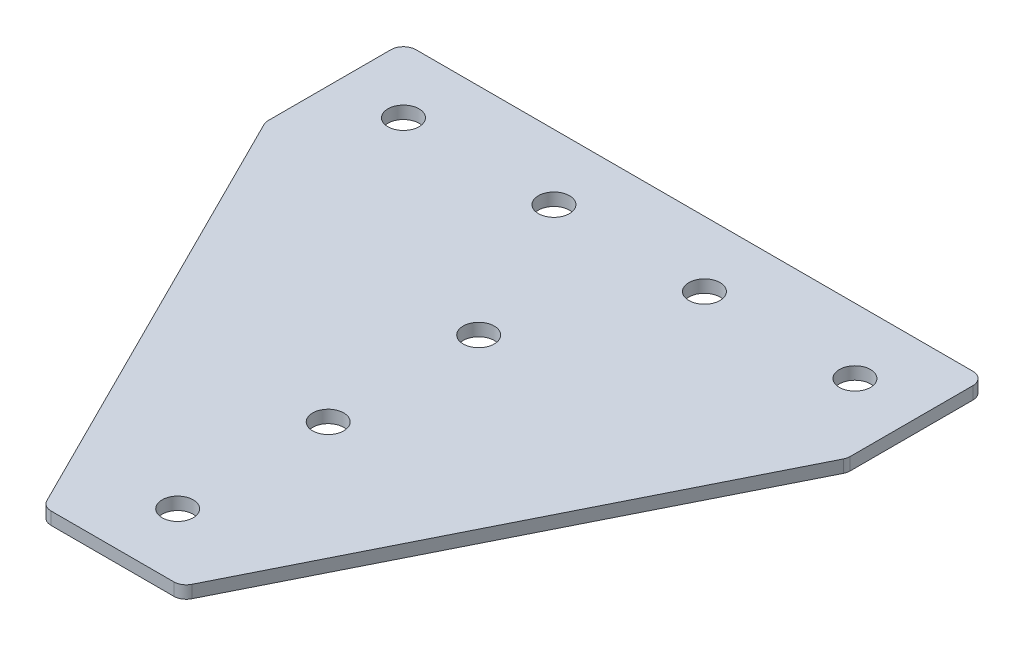
ISO-10303-21;
HEADER;
FILE_DESCRIPTION(('STEP AP214'),'2;1');
FILE_NAME('part.step','',(''),(''),'','','');
FILE_SCHEMA(('AUTOMOTIVE_DESIGN { 1 0 10303 214 1 1 1 1 }'));
ENDSEC;
DATA;
#1=APPLICATION_CONTEXT('core data for automotive mechanical design processes');
#2=APPLICATION_PROTOCOL_DEFINITION('international standard','automotive_design',2000,#1);
#3=PRODUCT_CONTEXT('',#1,'mechanical');
#4=PRODUCT('Part','Part','',(#3));
#5=PRODUCT_RELATED_PRODUCT_CATEGORY('part','',(#4));
#6=PRODUCT_DEFINITION_FORMATION('','',#4);
#7=PRODUCT_DEFINITION_CONTEXT('part definition',#1,'design');
#8=PRODUCT_DEFINITION('design','',#6,#7);
#9=PRODUCT_DEFINITION_SHAPE('','',#8);
#10=(LENGTH_UNIT() NAMED_UNIT(*) SI_UNIT(.MILLI.,.METRE.));
#11=(NAMED_UNIT(*) PLANE_ANGLE_UNIT() SI_UNIT($,.RADIAN.));
#12=(NAMED_UNIT(*) SI_UNIT($,.STERADIAN.) SOLID_ANGLE_UNIT());
#13=UNCERTAINTY_MEASURE_WITH_UNIT(LENGTH_MEASURE(1.E-05),#10,'distance_accuracy_value','');
#14=(GEOMETRIC_REPRESENTATION_CONTEXT(3) GLOBAL_UNCERTAINTY_ASSIGNED_CONTEXT((#13)) GLOBAL_UNIT_ASSIGNED_CONTEXT((#10,
#11,#12)) REPRESENTATION_CONTEXT('',''));
#15=CARTESIAN_POINT('',(0.,0.,0.));
#16=DIRECTION('',(0.,0.,1.));
#17=DIRECTION('',(1.,0.,0.));
#18=AXIS2_PLACEMENT_3D('',#15,#16,#17);
#19=CARTESIAN_POINT('',(30.3085714285715,-1.25,-47.2019047619047));
#20=DIRECTION('',(0.,-1.,0.));
#21=DIRECTION('',(0.,0.,-1.));
#22=AXIS2_PLACEMENT_3D('',#19,#20,#21);
#23=PLANE('',#22);
#24=CARTESIAN_POINT('',(30.3085714285715,-1.25,-17.2019047619047));
#25=DIRECTION('',(0.,1.,0.));
#26=DIRECTION('',(0.,0.,1.));
#27=AXIS2_PLACEMENT_3D('',#24,#25,#26);
#28=CIRCLE('',#27,3.1);
#29=CARTESIAN_POINT('',(30.3085714285715,-1.25,-14.1019047619047));
#30=VERTEX_POINT('',#29);
#31=EDGE_CURVE('E183',#30,#30,#28,.T.);
#32=ORIENTED_EDGE('',*,*,#31,.T.);
#33=EDGE_LOOP('',(#32));
#34=FACE_BOUND('',#33,.T.);
#35=DIRECTION('',(1.,0.,0.));
#36=VECTOR('',#35,1.);
#37=CARTESIAN_POINT('',(17.3085714285714,-1.25,55.7980952380952));
#38=LINE('',#37,#36);
#39=CARTESIAN_POINT('',(18.0897243779459,-1.25,55.7980952380952));
#40=VERTEX_POINT('',#39);
#41=CARTESIAN_POINT('',(42.527418479197,-1.25,55.7980952380952));
#42=VERTEX_POINT('',#41);
#43=EDGE_CURVE('E201',#40,#42,#38,.T.);
#44=ORIENTED_EDGE('',*,*,#43,.F.);
#45=CARTESIAN_POINT('',(18.0897243779459,-1.25,53.2980952380952));
#46=DIRECTION('',(0.,1.,0.));
#47=DIRECTION('',(0.,0.,-1.));
#48=AXIS2_PLACEMENT_3D('',#45,#46,#47);
#49=CIRCLE('',#48,2.5);
#50=CARTESIAN_POINT('',(15.8536564004461,-1.25,54.4161292268451));
#51=VERTEX_POINT('',#50);
#52=EDGE_CURVE('E155',#51,#40,#49,.T.);
#53=ORIENTED_EDGE('',*,*,#52,.F.);
#54=DIRECTION('',(-0.447213595499957,0.,-0.894427190999917));
#55=VECTOR('',#54,1.);
#56=CARTESIAN_POINT('',(16.5446394060712,-1.25,55.7980952380952));
#57=LINE('',#56,#55);
#58=CARTESIAN_POINT('',(-27.4274965489282,-1.25,-32.1461766719039));
#59=VERTEX_POINT('',#58);
#60=EDGE_CURVE('E142',#51,#59,#57,.T.);
#61=ORIENTED_EDGE('',*,*,#60,.T.);
#62=CARTESIAN_POINT('',(-25.1914285714284,-1.25,-33.2642106606537));
#63=DIRECTION('',(0.,1.,0.));
#64=DIRECTION('',(0.,0.,-1.));
#65=AXIS2_PLACEMENT_3D('',#62,#63,#64);
#66=CIRCLE('',#65,2.5);
#67=CARTESIAN_POINT('',(-27.6914285714284,-1.25,-33.2642106606537));
#68=VERTEX_POINT('',#67);
#69=EDGE_CURVE('E153',#68,#59,#66,.T.);
#70=ORIENTED_EDGE('',*,*,#69,.F.);
#71=DIRECTION('',(0.,0.,-1.));
#72=VECTOR('',#71,1.);
#73=CARTESIAN_POINT('',(-27.6914285714284,-1.25,-32.6740407169042));
#74=LINE('',#73,#72);
#75=CARTESIAN_POINT('',(-27.6914285714284,-1.25,-57.7019047619047));
#76=VERTEX_POINT('',#75);
#77=EDGE_CURVE('E124',#68,#76,#74,.T.);
#78=ORIENTED_EDGE('',*,*,#77,.T.);
#79=CARTESIAN_POINT('',(-25.1914285714284,-1.25,-57.7019047619047));
#80=DIRECTION('',(0.,1.,0.));
#81=DIRECTION('',(0.,0.,-1.));
#82=AXIS2_PLACEMENT_3D('',#79,#80,#81);
#83=CIRCLE('',#82,2.5);
#84=CARTESIAN_POINT('',(-25.1914285714284,-1.25,-60.2019047619047));
#85=VERTEX_POINT('',#84);
#86=EDGE_CURVE('E150',#85,#76,#83,.T.);
#87=ORIENTED_EDGE('',*,*,#86,.F.);
#88=DIRECTION('',(-1.,0.,0.));
#89=VECTOR('',#88,1.);
#90=CARTESIAN_POINT('',(88.3085714285713,-1.25,-60.2019047619048));
#91=LINE('',#90,#89);
#92=CARTESIAN_POINT('',(85.8085714285713,-1.25,-60.2019047619048));
#93=VERTEX_POINT('',#92);
#94=EDGE_CURVE('E198',#93,#85,#91,.T.);
#95=ORIENTED_EDGE('',*,*,#94,.F.);
#96=CARTESIAN_POINT('',(85.8085714285713,-1.25,-57.7019047619048));
#97=DIRECTION('',(0.,-1.,0.));
#98=DIRECTION('',(0.,0.,-1.));
#99=AXIS2_PLACEMENT_3D('',#96,#97,#98);
#100=CIRCLE('',#99,2.5);
#101=CARTESIAN_POINT('',(88.3085714285713,-1.25,-57.7019047619048));
#102=VERTEX_POINT('',#101);
#103=EDGE_CURVE('E222',#93,#102,#100,.T.);
#104=ORIENTED_EDGE('',*,*,#103,.T.);
#105=DIRECTION('',(0.,0.,-1.));
#106=VECTOR('',#105,1.);
#107=CARTESIAN_POINT('',(88.3085714285713,-1.25,-32.6740407169043));
#108=LINE('',#107,#106);
#109=CARTESIAN_POINT('',(88.3085714285713,-1.25,-33.2642106606537));
#110=VERTEX_POINT('',#109);
#111=EDGE_CURVE('E195',#110,#102,#108,.T.);
#112=ORIENTED_EDGE('',*,*,#111,.F.);
#113=CARTESIAN_POINT('',(85.8085714285713,-1.25,-33.2642106606537));
#114=DIRECTION('',(0.,-1.,0.));
#115=DIRECTION('',(0.,0.,-1.));
#116=AXIS2_PLACEMENT_3D('',#113,#114,#115);
#117=CIRCLE('',#116,2.5);
#118=CARTESIAN_POINT('',(88.0446394060712,-1.25,-32.1461766719039));
#119=VERTEX_POINT('',#118);
#120=EDGE_CURVE('E31',#110,#119,#117,.T.);
#121=ORIENTED_EDGE('',*,*,#120,.T.);
#122=DIRECTION('',(0.447213595499957,0.,-0.894427190999917));
#123=VECTOR('',#122,1.);
#124=CARTESIAN_POINT('',(44.0725034510718,-1.25,55.7980952380952));
#125=LINE('',#124,#123);
#126=CARTESIAN_POINT('',(44.7634864566968,-1.25,54.4161292268451));
#127=VERTEX_POINT('',#126);
#128=EDGE_CURVE('E203',#127,#119,#125,.T.);
#129=ORIENTED_EDGE('',*,*,#128,.F.);
#130=CARTESIAN_POINT('',(42.527418479197,-1.25,53.2980952380952));
#131=DIRECTION('',(0.,-1.,0.));
#132=DIRECTION('',(0.,0.,-1.));
#133=AXIS2_PLACEMENT_3D('',#130,#131,#132);
#134=CIRCLE('',#133,2.5);
#135=EDGE_CURVE('E225',#127,#42,#134,.T.);
#136=ORIENTED_EDGE('',*,*,#135,.T.);
#137=EDGE_LOOP('',(#44,#53,#61,#70,#78,#87,#95,#104,#112,#121,#129,#136));
#138=FACE_BOUND('',#137,.T.);
#139=CARTESIAN_POINT('',(30.3085714285715,-1.25,42.7980952380953));
#140=DIRECTION('',(0.,1.,0.));
#141=DIRECTION('',(0.,0.,1.));
#142=AXIS2_PLACEMENT_3D('',#139,#140,#141);
#143=CIRCLE('',#142,3.1);
#144=CARTESIAN_POINT('',(30.3085714285715,-1.25,45.8980952380953));
#145=VERTEX_POINT('',#144);
#146=EDGE_CURVE('E171',#145,#145,#143,.T.);
#147=ORIENTED_EDGE('',*,*,#146,.T.);
#148=EDGE_LOOP('',(#147));
#149=FACE_BOUND('',#148,.T.);
#150=CARTESIAN_POINT('',(30.3085714285715,-1.25,12.7980952380953));
#151=DIRECTION('',(0.,1.,0.));
#152=DIRECTION('',(0.,0.,1.));
#153=AXIS2_PLACEMENT_3D('',#150,#151,#152);
#154=CIRCLE('',#153,3.1);
#155=CARTESIAN_POINT('',(30.3085714285715,-1.25,15.8980952380953));
#156=VERTEX_POINT('',#155);
#157=EDGE_CURVE('E177',#156,#156,#154,.T.);
#158=ORIENTED_EDGE('',*,*,#157,.T.);
#159=EDGE_LOOP('',(#158));
#160=FACE_BOUND('',#159,.T.);
#161=CARTESIAN_POINT('',(75.3085714285715,-1.25,-47.2019047619047));
#162=DIRECTION('',(0.,1.,0.));
#163=DIRECTION('',(0.,0.,1.));
#164=AXIS2_PLACEMENT_3D('',#161,#162,#163);
#165=CIRCLE('',#164,3.1);
#166=CARTESIAN_POINT('',(75.3085714285715,-1.25,-44.1019047619047));
#167=VERTEX_POINT('',#166);
#168=EDGE_CURVE('E165',#167,#167,#165,.T.);
#169=ORIENTED_EDGE('',*,*,#168,.T.);
#170=EDGE_LOOP('',(#169));
#171=FACE_BOUND('',#170,.T.);
#172=CARTESIAN_POINT('',(45.3085714285715,-1.25,-47.2019047619047));
#173=DIRECTION('',(0.,1.,0.));
#174=DIRECTION('',(0.,0.,1.));
#175=AXIS2_PLACEMENT_3D('',#172,#173,#174);
#176=CIRCLE('',#175,3.1);
#177=CARTESIAN_POINT('',(45.3085714285715,-1.25,-44.1019047619047));
#178=VERTEX_POINT('',#177);
#179=EDGE_CURVE('E189',#178,#178,#176,.T.);
#180=ORIENTED_EDGE('',*,*,#179,.T.);
#181=EDGE_LOOP('',(#180));
#182=FACE_BOUND('',#181,.T.);
#183=CARTESIAN_POINT('',(-14.6914285714285,-1.25,-47.2019047619047));
#184=DIRECTION('',(0.,-1.,0.));
#185=DIRECTION('',(0.,0.,1.));
#186=AXIS2_PLACEMENT_3D('',#183,#184,#185);
#187=CIRCLE('',#186,3.1);
#188=CARTESIAN_POINT('',(-14.6914285714285,-1.25,-44.1019047619047));
#189=VERTEX_POINT('',#188);
#190=EDGE_CURVE('E265',#189,#189,#187,.T.);
#191=ORIENTED_EDGE('',*,*,#190,.F.);
#192=EDGE_LOOP('',(#191));
#193=FACE_BOUND('',#192,.T.);
#194=CARTESIAN_POINT('',(15.3085714285715,-1.25,-47.2019047619047));
#195=DIRECTION('',(0.,-1.,0.));
#196=DIRECTION('',(0.,0.,1.));
#197=AXIS2_PLACEMENT_3D('',#194,#195,#196);
#198=CIRCLE('',#197,3.1);
#199=CARTESIAN_POINT('',(15.3085714285715,-1.25,-44.1019047619047));
#200=VERTEX_POINT('',#199);
#201=EDGE_CURVE('E135',#200,#200,#198,.T.);
#202=ORIENTED_EDGE('',*,*,#201,.F.);
#203=EDGE_LOOP('',(#202));
#204=FACE_BOUND('',#203,.T.);
#205=ADVANCED_FACE('F16',(#34,#138,#149,#160,#171,#182,#193,#204),#23,.T.);
#206=CARTESIAN_POINT('',(88.3085714285713,-1.25,-32.6740407169043));
#207=DIRECTION('',(1.,0.,0.));
#208=DIRECTION('',(0.,0.,-1.));
#209=AXIS2_PLACEMENT_3D('',#206,#207,#208);
#210=PLANE('',#209);
#211=DIRECTION('',(0.,0.,-1.));
#212=VECTOR('',#211,1.);
#213=CARTESIAN_POINT('',(88.3085714285713,1.25,-32.6740407169043));
#214=LINE('',#213,#212);
#215=CARTESIAN_POINT('',(88.3085714285713,1.25,-33.2642106606537));
#216=VERTEX_POINT('',#215);
#217=CARTESIAN_POINT('',(88.3085714285713,1.25,-57.7019047619048));
#218=VERTEX_POINT('',#217);
#219=EDGE_CURVE('E192',#216,#218,#214,.T.);
#220=ORIENTED_EDGE('',*,*,#219,.F.);
#221=DIRECTION('',(0.,1.,0.));
#222=VECTOR('',#221,1.);
#223=CARTESIAN_POINT('',(88.3085714285713,-1.25,-33.2642106606537));
#224=LINE('',#223,#222);
#225=EDGE_CURVE('E24',#216,#110,#224,.F.);
#226=ORIENTED_EDGE('',*,*,#225,.T.);
#227=ORIENTED_EDGE('',*,*,#111,.T.);
#228=DIRECTION('',(0.,1.,0.));
#229=VECTOR('',#228,1.);
#230=CARTESIAN_POINT('',(88.3085714285713,-1.25,-57.7019047619048));
#231=LINE('',#230,#229);
#232=EDGE_CURVE('E232',#102,#218,#231,.T.);
#233=ORIENTED_EDGE('',*,*,#232,.T.);
#234=EDGE_LOOP('',(#220,#226,#227,#233));
#235=FACE_BOUND('',#234,.T.);
#236=ADVANCED_FACE('F237',(#235),#210,.T.);
#237=CARTESIAN_POINT('',(44.0725034510718,-1.25,55.7980952380952));
#238=DIRECTION('',(0.894427190999916,0.,0.447213595499956));
#239=DIRECTION('',(0.447213595499957,0.,-0.894427190999917));
#240=AXIS2_PLACEMENT_3D('',#237,#238,#239);
#241=PLANE('',#240);
#242=DIRECTION('',(0.447213595499957,0.,-0.894427190999917));
#243=VECTOR('',#242,1.);
#244=CARTESIAN_POINT('',(44.0725034510718,1.25,55.7980952380952));
#245=LINE('',#244,#243);
#246=CARTESIAN_POINT('',(44.7634864566968,1.25,54.4161292268451));
#247=VERTEX_POINT('',#246);
#248=CARTESIAN_POINT('',(88.0446394060712,1.25,-32.1461766719039));
#249=VERTEX_POINT('',#248);
#250=EDGE_CURVE('E199',#247,#249,#245,.T.);
#251=ORIENTED_EDGE('',*,*,#250,.F.);
#252=DIRECTION('',(0.,1.,0.));
#253=VECTOR('',#252,1.);
#254=CARTESIAN_POINT('',(44.7634864566968,-1.25,54.4161292268451));
#255=LINE('',#254,#253);
#256=EDGE_CURVE('E38',#247,#127,#255,.F.);
#257=ORIENTED_EDGE('',*,*,#256,.T.);
#258=ORIENTED_EDGE('',*,*,#128,.T.);
#259=DIRECTION('',(0.,1.,0.));
#260=VECTOR('',#259,1.);
#261=CARTESIAN_POINT('',(88.0446394060711,-1.25,-32.1461766719038));
#262=LINE('',#261,#260);
#263=EDGE_CURVE('E228',#119,#249,#262,.T.);
#264=ORIENTED_EDGE('',*,*,#263,.T.);
#265=EDGE_LOOP('',(#251,#257,#258,#264));
#266=FACE_BOUND('',#265,.T.);
#267=ADVANCED_FACE('F245',(#266),#241,.T.);
#268=CARTESIAN_POINT('',(17.3085714285714,-1.25,55.7980952380952));
#269=DIRECTION('',(0.,0.,1.));
#270=DIRECTION('',(1.,0.,0.));
#271=AXIS2_PLACEMENT_3D('',#268,#269,#270);
#272=PLANE('',#271);
#273=DIRECTION('',(1.,0.,0.));
#274=VECTOR('',#273,1.);
#275=CARTESIAN_POINT('',(17.3085714285714,1.25,55.7980952380952));
#276=LINE('',#275,#274);
#277=CARTESIAN_POINT('',(18.0897243779459,1.25,55.7980952380952));
#278=VERTEX_POINT('',#277);
#279=CARTESIAN_POINT('',(42.527418479197,1.25,55.7980952380952));
#280=VERTEX_POINT('',#279);
#281=EDGE_CURVE('E210',#278,#280,#276,.T.);
#282=ORIENTED_EDGE('',*,*,#281,.F.);
#283=DIRECTION('',(0.,1.,0.));
#284=VECTOR('',#283,1.);
#285=CARTESIAN_POINT('',(18.0897243779459,-1.25,55.7980952380952));
#286=LINE('',#285,#284);
#287=EDGE_CURVE('E147',#40,#278,#286,.T.);
#288=ORIENTED_EDGE('',*,*,#287,.F.);
#289=ORIENTED_EDGE('',*,*,#43,.T.);
#290=DIRECTION('',(0.,1.,0.));
#291=VECTOR('',#290,1.);
#292=CARTESIAN_POINT('',(42.527418479197,-1.25,55.7980952380952));
#293=LINE('',#292,#291);
#294=EDGE_CURVE('E219',#42,#280,#293,.T.);
#295=ORIENTED_EDGE('',*,*,#294,.T.);
#296=EDGE_LOOP('',(#282,#288,#289,#295));
#297=FACE_BOUND('',#296,.T.);
#298=ADVANCED_FACE('F252',(#297),#272,.T.);
#299=CARTESIAN_POINT('',(88.3085714285713,-1.25,-60.2019047619048));
#300=DIRECTION('',(0.,0.,-1.));
#301=DIRECTION('',(-1.,0.,0.));
#302=AXIS2_PLACEMENT_3D('',#299,#300,#301);
#303=PLANE('',#302);
#304=ORIENTED_EDGE('',*,*,#94,.T.);
#305=DIRECTION('',(0.,1.,0.));
#306=VECTOR('',#305,1.);
#307=CARTESIAN_POINT('',(-25.1914285714284,-1.25,-60.2019047619047));
#308=LINE('',#307,#306);
#309=CARTESIAN_POINT('',(-25.1914285714284,1.25,-60.2019047619047));
#310=VERTEX_POINT('',#309);
#311=EDGE_CURVE('E126',#310,#85,#308,.F.);
#312=ORIENTED_EDGE('',*,*,#311,.F.);
#313=DIRECTION('',(-1.,0.,0.));
#314=VECTOR('',#313,1.);
#315=CARTESIAN_POINT('',(88.3085714285713,1.25,-60.2019047619048));
#316=LINE('',#315,#314);
#317=CARTESIAN_POINT('',(85.8085714285713,1.25,-60.2019047619048));
#318=VERTEX_POINT('',#317);
#319=EDGE_CURVE('E208',#318,#310,#316,.T.);
#320=ORIENTED_EDGE('',*,*,#319,.F.);
#321=DIRECTION('',(0.,1.,0.));
#322=VECTOR('',#321,1.);
#323=CARTESIAN_POINT('',(85.8085714285713,-1.25,-60.2019047619048));
#324=LINE('',#323,#322);
#325=EDGE_CURVE('E10',#318,#93,#324,.F.);
#326=ORIENTED_EDGE('',*,*,#325,.T.);
#327=EDGE_LOOP('',(#304,#312,#320,#326));
#328=FACE_BOUND('',#327,.T.);
#329=ADVANCED_FACE('F290',(#328),#303,.T.);
#330=CARTESIAN_POINT('',(30.3085714285715,1.25,-47.2019047619047));
#331=DIRECTION('',(0.,-1.,0.));
#332=DIRECTION('',(0.,0.,-1.));
#333=AXIS2_PLACEMENT_3D('',#330,#331,#332);
#334=PLANE('',#333);
#335=CARTESIAN_POINT('',(30.3085714285715,1.25,-17.2019047619047));
#336=DIRECTION('',(0.,1.,0.));
#337=DIRECTION('',(0.,0.,1.));
#338=AXIS2_PLACEMENT_3D('',#335,#336,#337);
#339=CIRCLE('',#338,3.1);
#340=CARTESIAN_POINT('',(30.3085714285715,1.25,-14.1019047619047));
#341=VERTEX_POINT('',#340);
#342=EDGE_CURVE('E180',#341,#341,#339,.T.);
#343=ORIENTED_EDGE('',*,*,#342,.F.);
#344=EDGE_LOOP('',(#343));
#345=FACE_BOUND('',#344,.T.);
#346=CARTESIAN_POINT('',(18.0897243779459,1.25,53.2980952380952));
#347=DIRECTION('',(0.,1.,0.));
#348=DIRECTION('',(0.,0.,-1.));
#349=AXIS2_PLACEMENT_3D('',#346,#347,#348);
#350=CIRCLE('',#349,2.5);
#351=CARTESIAN_POINT('',(15.8536564004461,1.25,54.4161292268451));
#352=VERTEX_POINT('',#351);
#353=EDGE_CURVE('E116',#278,#352,#350,.F.);
#354=ORIENTED_EDGE('',*,*,#353,.F.);
#355=ORIENTED_EDGE('',*,*,#281,.T.);
#356=CARTESIAN_POINT('',(42.527418479197,1.25,53.2980952380952));
#357=DIRECTION('',(0.,-1.,0.));
#358=DIRECTION('',(0.,0.,-1.));
#359=AXIS2_PLACEMENT_3D('',#356,#357,#358);
#360=CIRCLE('',#359,2.5);
#361=EDGE_CURVE('E217',#280,#247,#360,.F.);
#362=ORIENTED_EDGE('',*,*,#361,.T.);
#363=ORIENTED_EDGE('',*,*,#250,.T.);
#364=CARTESIAN_POINT('',(85.8085714285713,1.25,-33.2642106606537));
#365=DIRECTION('',(0.,-1.,0.));
#366=DIRECTION('',(0.,0.,-1.));
#367=AXIS2_PLACEMENT_3D('',#364,#365,#366);
#368=CIRCLE('',#367,2.5);
#369=EDGE_CURVE('E215',#249,#216,#368,.F.);
#370=ORIENTED_EDGE('',*,*,#369,.T.);
#371=ORIENTED_EDGE('',*,*,#219,.T.);
#372=CARTESIAN_POINT('',(85.8085714285713,1.25,-57.7019047619048));
#373=DIRECTION('',(0.,-1.,0.));
#374=DIRECTION('',(0.,0.,-1.));
#375=AXIS2_PLACEMENT_3D('',#372,#373,#374);
#376=CIRCLE('',#375,2.5);
#377=EDGE_CURVE('E205',#218,#318,#376,.F.);
#378=ORIENTED_EDGE('',*,*,#377,.T.);
#379=ORIENTED_EDGE('',*,*,#319,.T.);
#380=CARTESIAN_POINT('',(-25.1914285714284,1.25,-57.7019047619047));
#381=DIRECTION('',(0.,1.,0.));
#382=DIRECTION('',(0.,0.,-1.));
#383=AXIS2_PLACEMENT_3D('',#380,#381,#382);
#384=CIRCLE('',#383,2.5);
#385=CARTESIAN_POINT('',(-27.6914285714284,1.25,-57.7019047619047));
#386=VERTEX_POINT('',#385);
#387=EDGE_CURVE('E117',#386,#310,#384,.F.);
#388=ORIENTED_EDGE('',*,*,#387,.F.);
#389=DIRECTION('',(0.,0.,-1.));
#390=VECTOR('',#389,1.);
#391=CARTESIAN_POINT('',(-27.6914285714284,1.25,-32.6740407169042));
#392=LINE('',#391,#390);
#393=CARTESIAN_POINT('',(-27.6914285714284,1.25,-33.2642106606537));
#394=VERTEX_POINT('',#393);
#395=EDGE_CURVE('E122',#394,#386,#392,.T.);
#396=ORIENTED_EDGE('',*,*,#395,.F.);
#397=CARTESIAN_POINT('',(-25.1914285714284,1.25,-33.2642106606537));
#398=DIRECTION('',(0.,1.,0.));
#399=DIRECTION('',(0.,0.,-1.));
#400=AXIS2_PLACEMENT_3D('',#397,#398,#399);
#401=CIRCLE('',#400,2.5);
#402=CARTESIAN_POINT('',(-27.4274965489282,1.25,-32.1461766719039));
#403=VERTEX_POINT('',#402);
#404=EDGE_CURVE('E105',#403,#394,#401,.F.);
#405=ORIENTED_EDGE('',*,*,#404,.F.);
#406=DIRECTION('',(-0.447213595499957,0.,-0.894427190999917));
#407=VECTOR('',#406,1.);
#408=CARTESIAN_POINT('',(16.5446394060712,1.25,55.7980952380952));
#409=LINE('',#408,#407);
#410=EDGE_CURVE('E134',#352,#403,#409,.T.);
#411=ORIENTED_EDGE('',*,*,#410,.F.);
#412=EDGE_LOOP('',(#354,#355,#362,#363,#370,#371,#378,#379,#388,#396,#405,#411));
#413=FACE_BOUND('',#412,.T.);
#414=CARTESIAN_POINT('',(30.3085714285715,1.25,42.7980952380953));
#415=DIRECTION('',(0.,1.,0.));
#416=DIRECTION('',(0.,0.,1.));
#417=AXIS2_PLACEMENT_3D('',#414,#415,#416);
#418=CIRCLE('',#417,3.1);
#419=CARTESIAN_POINT('',(30.3085714285715,1.25,45.8980952380953));
#420=VERTEX_POINT('',#419);
#421=EDGE_CURVE('E168',#420,#420,#418,.T.);
#422=ORIENTED_EDGE('',*,*,#421,.F.);
#423=EDGE_LOOP('',(#422));
#424=FACE_BOUND('',#423,.T.);
#425=CARTESIAN_POINT('',(75.3085714285715,1.25,-47.2019047619047));
#426=DIRECTION('',(0.,1.,0.));
#427=DIRECTION('',(0.,0.,1.));
#428=AXIS2_PLACEMENT_3D('',#425,#426,#427);
#429=CIRCLE('',#428,3.1);
#430=CARTESIAN_POINT('',(75.3085714285715,1.25,-44.1019047619047));
#431=VERTEX_POINT('',#430);
#432=EDGE_CURVE('E164',#431,#431,#429,.T.);
#433=ORIENTED_EDGE('',*,*,#432,.F.);
#434=EDGE_LOOP('',(#433));
#435=FACE_BOUND('',#434,.T.);
#436=CARTESIAN_POINT('',(30.3085714285715,1.25,12.7980952380953));
#437=DIRECTION('',(0.,1.,0.));
#438=DIRECTION('',(0.,0.,1.));
#439=AXIS2_PLACEMENT_3D('',#436,#437,#438);
#440=CIRCLE('',#439,3.1);
#441=CARTESIAN_POINT('',(30.3085714285715,1.25,15.8980952380953));
#442=VERTEX_POINT('',#441);
#443=EDGE_CURVE('E174',#442,#442,#440,.T.);
#444=ORIENTED_EDGE('',*,*,#443,.F.);
#445=EDGE_LOOP('',(#444));
#446=FACE_BOUND('',#445,.T.);
#447=CARTESIAN_POINT('',(45.3085714285715,1.25,-47.2019047619047));
#448=DIRECTION('',(0.,1.,0.));
#449=DIRECTION('',(0.,0.,1.));
#450=AXIS2_PLACEMENT_3D('',#447,#448,#449);
#451=CIRCLE('',#450,3.1);
#452=CARTESIAN_POINT('',(45.3085714285715,1.25,-44.1019047619047));
#453=VERTEX_POINT('',#452);
#454=EDGE_CURVE('E186',#453,#453,#451,.T.);
#455=ORIENTED_EDGE('',*,*,#454,.F.);
#456=EDGE_LOOP('',(#455));
#457=FACE_BOUND('',#456,.T.);
#458=CARTESIAN_POINT('',(-14.6914285714285,1.25,-47.2019047619047));
#459=DIRECTION('',(0.,-1.,0.));
#460=DIRECTION('',(0.,0.,1.));
#461=AXIS2_PLACEMENT_3D('',#458,#459,#460);
#462=CIRCLE('',#461,3.1);
#463=CARTESIAN_POINT('',(-14.6914285714285,1.25,-44.1019047619047));
#464=VERTEX_POINT('',#463);
#465=EDGE_CURVE('E267',#464,#464,#462,.T.);
#466=ORIENTED_EDGE('',*,*,#465,.T.);
#467=EDGE_LOOP('',(#466));
#468=FACE_BOUND('',#467,.T.);
#469=CARTESIAN_POINT('',(15.3085714285715,1.25,-47.2019047619047));
#470=DIRECTION('',(0.,-1.,0.));
#471=DIRECTION('',(0.,0.,1.));
#472=AXIS2_PLACEMENT_3D('',#469,#470,#471);
#473=CIRCLE('',#472,3.1);
#474=CARTESIAN_POINT('',(15.3085714285715,1.25,-44.1019047619047));
#475=VERTEX_POINT('',#474);
#476=EDGE_CURVE('E139',#475,#475,#473,.T.);
#477=ORIENTED_EDGE('',*,*,#476,.T.);
#478=EDGE_LOOP('',(#477));
#479=FACE_BOUND('',#478,.T.);
#480=ADVANCED_FACE('F130',(#345,#413,#424,#435,#446,#457,#468,#479),#334,.F.);
#481=CARTESIAN_POINT('',(42.527418479197,-1.25,53.2980952380952));
#482=DIRECTION('',(0.,1.,0.));
#483=DIRECTION('',(0.,0.,1.));
#484=AXIS2_PLACEMENT_3D('',#481,#482,#483);
#485=CYLINDRICAL_SURFACE('',#484,2.5);
#486=ORIENTED_EDGE('',*,*,#135,.F.);
#487=ORIENTED_EDGE('',*,*,#256,.F.);
#488=ORIENTED_EDGE('',*,*,#361,.F.);
#489=ORIENTED_EDGE('',*,*,#294,.F.);
#490=EDGE_LOOP('',(#486,#487,#488,#489));
#491=FACE_BOUND('',#490,.T.);
#492=ADVANCED_FACE('F250',(#491),#485,.T.);
#493=CARTESIAN_POINT('',(85.8085714285713,-1.25,-33.2642106606537));
#494=DIRECTION('',(0.,1.,0.));
#495=DIRECTION('',(0.,0.,1.));
#496=AXIS2_PLACEMENT_3D('',#493,#494,#495);
#497=CYLINDRICAL_SURFACE('',#496,2.5);
#498=ORIENTED_EDGE('',*,*,#120,.F.);
#499=ORIENTED_EDGE('',*,*,#225,.F.);
#500=ORIENTED_EDGE('',*,*,#369,.F.);
#501=ORIENTED_EDGE('',*,*,#263,.F.);
#502=EDGE_LOOP('',(#498,#499,#500,#501));
#503=FACE_BOUND('',#502,.T.);
#504=ADVANCED_FACE('F244',(#503),#497,.T.);
#505=CARTESIAN_POINT('',(85.8085714285713,-1.25,-57.7019047619048));
#506=DIRECTION('',(0.,1.,0.));
#507=DIRECTION('',(0.,0.,1.));
#508=AXIS2_PLACEMENT_3D('',#505,#506,#507);
#509=CYLINDRICAL_SURFACE('',#508,2.5);
#510=ORIENTED_EDGE('',*,*,#103,.F.);
#511=ORIENTED_EDGE('',*,*,#325,.F.);
#512=ORIENTED_EDGE('',*,*,#377,.F.);
#513=ORIENTED_EDGE('',*,*,#232,.F.);
#514=EDGE_LOOP('',(#510,#511,#512,#513));
#515=FACE_BOUND('',#514,.T.);
#516=ADVANCED_FACE('F18',(#515),#509,.T.);
#517=CARTESIAN_POINT('',(45.3085714285715,-1.25,-47.2019047619047));
#518=DIRECTION('',(0.,1.,0.));
#519=DIRECTION('',(0.,0.,1.));
#520=AXIS2_PLACEMENT_3D('',#517,#518,#519);
#521=CYLINDRICAL_SURFACE('',#520,3.1);
#522=ORIENTED_EDGE('',*,*,#179,.F.);
#523=EDGE_LOOP('',(#522));
#524=FACE_BOUND('',#523,.T.);
#525=ORIENTED_EDGE('',*,*,#454,.T.);
#526=EDGE_LOOP('',(#525));
#527=FACE_BOUND('',#526,.T.);
#528=ADVANCED_FACE('F307',(#524,#527),#521,.F.);
#529=CARTESIAN_POINT('',(30.3085714285715,-1.25,-17.2019047619047));
#530=DIRECTION('',(0.,1.,0.));
#531=DIRECTION('',(0.,0.,1.));
#532=AXIS2_PLACEMENT_3D('',#529,#530,#531);
#533=CYLINDRICAL_SURFACE('',#532,3.1);
#534=ORIENTED_EDGE('',*,*,#31,.F.);
#535=EDGE_LOOP('',(#534));
#536=FACE_BOUND('',#535,.T.);
#537=ORIENTED_EDGE('',*,*,#342,.T.);
#538=EDGE_LOOP('',(#537));
#539=FACE_BOUND('',#538,.T.);
#540=ADVANCED_FACE('F312',(#536,#539),#533,.F.);
#541=CARTESIAN_POINT('',(30.3085714285715,-1.25,12.7980952380953));
#542=DIRECTION('',(0.,1.,0.));
#543=DIRECTION('',(0.,0.,1.));
#544=AXIS2_PLACEMENT_3D('',#541,#542,#543);
#545=CYLINDRICAL_SURFACE('',#544,3.1);
#546=ORIENTED_EDGE('',*,*,#443,.T.);
#547=EDGE_LOOP('',(#546));
#548=FACE_BOUND('',#547,.T.);
#549=ORIENTED_EDGE('',*,*,#157,.F.);
#550=EDGE_LOOP('',(#549));
#551=FACE_BOUND('',#550,.T.);
#552=ADVANCED_FACE('F334',(#548,#551),#545,.F.);
#553=CARTESIAN_POINT('',(30.3085714285715,-1.25,42.7980952380953));
#554=DIRECTION('',(0.,1.,0.));
#555=DIRECTION('',(0.,0.,1.));
#556=AXIS2_PLACEMENT_3D('',#553,#554,#555);
#557=CYLINDRICAL_SURFACE('',#556,3.1);
#558=ORIENTED_EDGE('',*,*,#421,.T.);
#559=EDGE_LOOP('',(#558));
#560=FACE_BOUND('',#559,.T.);
#561=ORIENTED_EDGE('',*,*,#146,.F.);
#562=EDGE_LOOP('',(#561));
#563=FACE_BOUND('',#562,.T.);
#564=ADVANCED_FACE('F330',(#560,#563),#557,.F.);
#565=CARTESIAN_POINT('',(75.3085714285715,-1.25,-47.2019047619047));
#566=DIRECTION('',(0.,1.,0.));
#567=DIRECTION('',(0.,0.,1.));
#568=AXIS2_PLACEMENT_3D('',#565,#566,#567);
#569=CYLINDRICAL_SURFACE('',#568,3.1);
#570=ORIENTED_EDGE('',*,*,#168,.F.);
#571=EDGE_LOOP('',(#570));
#572=FACE_BOUND('',#571,.T.);
#573=ORIENTED_EDGE('',*,*,#432,.T.);
#574=EDGE_LOOP('',(#573));
#575=FACE_BOUND('',#574,.T.);
#576=ADVANCED_FACE('F327',(#572,#575),#569,.F.);
#577=CARTESIAN_POINT('',(-27.6914285714284,-1.25,-32.6740407169042));
#578=DIRECTION('',(-1.,0.,0.));
#579=DIRECTION('',(0.,0.,-1.));
#580=AXIS2_PLACEMENT_3D('',#577,#578,#579);
#581=PLANE('',#580);
#582=ORIENTED_EDGE('',*,*,#395,.T.);
#583=DIRECTION('',(0.,1.,0.));
#584=VECTOR('',#583,1.);
#585=CARTESIAN_POINT('',(-27.6914285714284,-1.25,-57.7019047619047));
#586=LINE('',#585,#584);
#587=EDGE_CURVE('E127',#76,#386,#586,.T.);
#588=ORIENTED_EDGE('',*,*,#587,.F.);
#589=ORIENTED_EDGE('',*,*,#77,.F.);
#590=DIRECTION('',(0.,1.,0.));
#591=VECTOR('',#590,1.);
#592=CARTESIAN_POINT('',(-27.6914285714284,-1.25,-33.2642106606537));
#593=LINE('',#592,#591);
#594=EDGE_CURVE('E109',#394,#68,#593,.F.);
#595=ORIENTED_EDGE('',*,*,#594,.F.);
#596=EDGE_LOOP('',(#582,#588,#589,#595));
#597=FACE_BOUND('',#596,.T.);
#598=ADVANCED_FACE('F121',(#597),#581,.T.);
#599=CARTESIAN_POINT('',(16.5446394060712,-1.25,55.7980952380952));
#600=DIRECTION('',(-0.894427190999916,0.,0.447213595499957));
#601=DIRECTION('',(-0.447213595499957,0.,-0.894427190999917));
#602=AXIS2_PLACEMENT_3D('',#599,#600,#601);
#603=PLANE('',#602);
#604=ORIENTED_EDGE('',*,*,#410,.T.);
#605=DIRECTION('',(0.,1.,0.));
#606=VECTOR('',#605,1.);
#607=CARTESIAN_POINT('',(-27.4274965489282,-1.25,-32.1461766719038));
#608=LINE('',#607,#606);
#609=EDGE_CURVE('E111',#59,#403,#608,.T.);
#610=ORIENTED_EDGE('',*,*,#609,.F.);
#611=ORIENTED_EDGE('',*,*,#60,.F.);
#612=DIRECTION('',(0.,1.,0.));
#613=VECTOR('',#612,1.);
#614=CARTESIAN_POINT('',(15.8536564004461,-1.25,54.4161292268451));
#615=LINE('',#614,#613);
#616=EDGE_CURVE('E159',#352,#51,#615,.F.);
#617=ORIENTED_EDGE('',*,*,#616,.F.);
#618=EDGE_LOOP('',(#604,#610,#611,#617));
#619=FACE_BOUND('',#618,.T.);
#620=ADVANCED_FACE('F261',(#619),#603,.T.);
#621=CARTESIAN_POINT('',(18.0897243779459,-1.25,53.2980952380952));
#622=DIRECTION('',(0.,1.,0.));
#623=DIRECTION('',(0.,0.,1.));
#624=AXIS2_PLACEMENT_3D('',#621,#622,#623);
#625=CYLINDRICAL_SURFACE('',#624,2.5);
#626=ORIENTED_EDGE('',*,*,#52,.T.);
#627=ORIENTED_EDGE('',*,*,#287,.T.);
#628=ORIENTED_EDGE('',*,*,#353,.T.);
#629=ORIENTED_EDGE('',*,*,#616,.T.);
#630=EDGE_LOOP('',(#626,#627,#628,#629));
#631=FACE_BOUND('',#630,.T.);
#632=ADVANCED_FACE('F258',(#631),#625,.T.);
#633=CARTESIAN_POINT('',(-25.1914285714284,-1.25,-33.2642106606537));
#634=DIRECTION('',(0.,1.,0.));
#635=DIRECTION('',(0.,0.,1.));
#636=AXIS2_PLACEMENT_3D('',#633,#634,#635);
#637=CYLINDRICAL_SURFACE('',#636,2.5);
#638=ORIENTED_EDGE('',*,*,#69,.T.);
#639=ORIENTED_EDGE('',*,*,#609,.T.);
#640=ORIENTED_EDGE('',*,*,#404,.T.);
#641=ORIENTED_EDGE('',*,*,#594,.T.);
#642=EDGE_LOOP('',(#638,#639,#640,#641));
#643=FACE_BOUND('',#642,.T.);
#644=ADVANCED_FACE('F108',(#643),#637,.T.);
#645=CARTESIAN_POINT('',(-25.1914285714284,-1.25,-57.7019047619047));
#646=DIRECTION('',(0.,1.,0.));
#647=DIRECTION('',(0.,0.,1.));
#648=AXIS2_PLACEMENT_3D('',#645,#646,#647);
#649=CYLINDRICAL_SURFACE('',#648,2.5);
#650=ORIENTED_EDGE('',*,*,#86,.T.);
#651=ORIENTED_EDGE('',*,*,#587,.T.);
#652=ORIENTED_EDGE('',*,*,#387,.T.);
#653=ORIENTED_EDGE('',*,*,#311,.T.);
#654=EDGE_LOOP('',(#650,#651,#652,#653));
#655=FACE_BOUND('',#654,.T.);
#656=ADVANCED_FACE('F285',(#655),#649,.T.);
#657=CARTESIAN_POINT('',(15.3085714285715,-1.25,-47.2019047619047));
#658=DIRECTION('',(0.,1.,0.));
#659=DIRECTION('',(0.,0.,1.));
#660=AXIS2_PLACEMENT_3D('',#657,#658,#659);
#661=CYLINDRICAL_SURFACE('',#660,3.1);
#662=ORIENTED_EDGE('',*,*,#201,.T.);
#663=EDGE_LOOP('',(#662));
#664=FACE_BOUND('',#663,.T.);
#665=ORIENTED_EDGE('',*,*,#476,.F.);
#666=EDGE_LOOP('',(#665));
#667=FACE_BOUND('',#666,.T.);
#668=ADVANCED_FACE('F282',(#664,#667),#661,.F.);
#669=CARTESIAN_POINT('',(-14.6914285714285,-1.25,-47.2019047619047));
#670=DIRECTION('',(0.,1.,0.));
#671=DIRECTION('',(0.,0.,1.));
#672=AXIS2_PLACEMENT_3D('',#669,#670,#671);
#673=CYLINDRICAL_SURFACE('',#672,3.1);
#674=ORIENTED_EDGE('',*,*,#190,.T.);
#675=EDGE_LOOP('',(#674));
#676=FACE_BOUND('',#675,.T.);
#677=ORIENTED_EDGE('',*,*,#465,.F.);
#678=EDGE_LOOP('',(#677));
#679=FACE_BOUND('',#678,.T.);
#680=ADVANCED_FACE('F273',(#676,#679),#673,.F.);
#681=CLOSED_SHELL('',(#205,#236,#267,#298,#329,#480,#492,#504,#516,#528,#540,#552,#564,#576,
#598,#620,#632,#644,#656,#668,#680));
#682=MANIFOLD_SOLID_BREP('B1',#681);
#683=ADVANCED_BREP_SHAPE_REPRESENTATION('',(#18,#682),#14);
#684=SHAPE_DEFINITION_REPRESENTATION(#9,#683);
ENDSEC;
END-ISO-10303-21;
